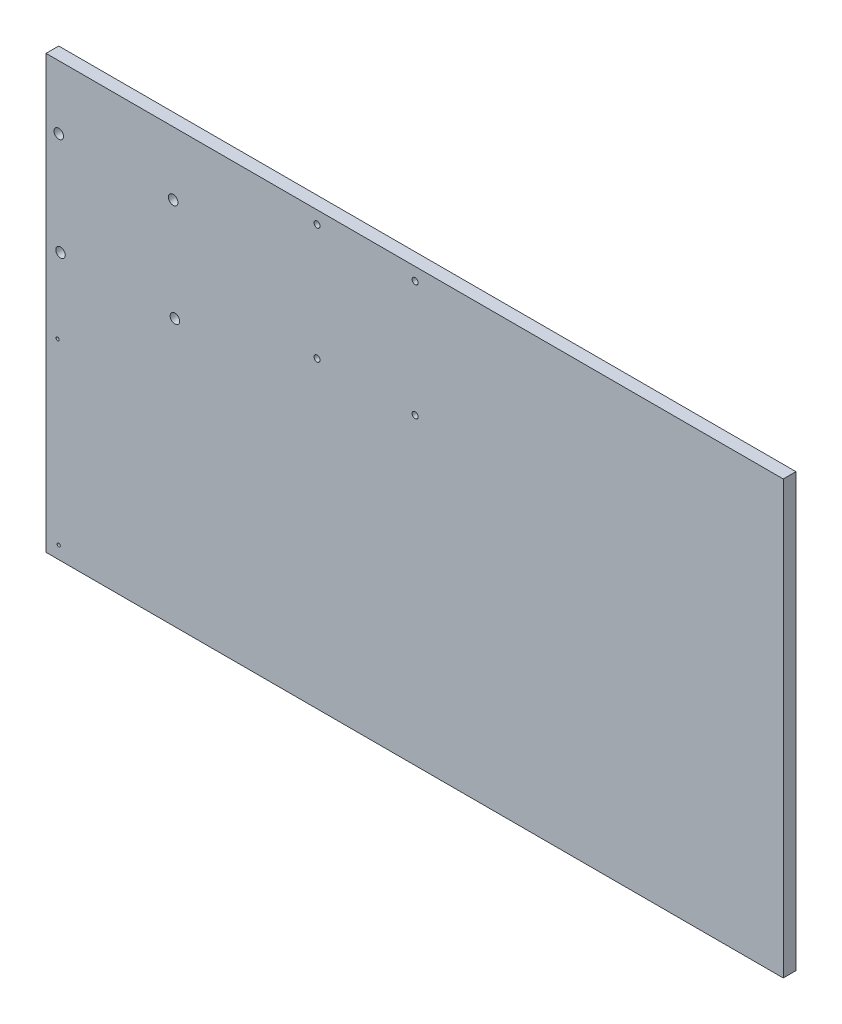
ISO-10303-21;
HEADER;
FILE_DESCRIPTION(('STEP AP214'),'2;1');
FILE_NAME('part.step','',(''),(''),'','','');
FILE_SCHEMA(('AUTOMOTIVE_DESIGN { 1 0 10303 214 1 1 1 1 }'));
ENDSEC;
DATA;
#1=APPLICATION_CONTEXT('core data for automotive mechanical design processes');
#2=APPLICATION_PROTOCOL_DEFINITION('international standard','automotive_design',2000,#1);
#3=PRODUCT_CONTEXT('',#1,'mechanical');
#4=PRODUCT('Part','Part','',(#3));
#5=PRODUCT_RELATED_PRODUCT_CATEGORY('part','',(#4));
#6=PRODUCT_DEFINITION_FORMATION('','',#4);
#7=PRODUCT_DEFINITION_CONTEXT('part definition',#1,'design');
#8=PRODUCT_DEFINITION('design','',#6,#7);
#9=PRODUCT_DEFINITION_SHAPE('','',#8);
#10=(LENGTH_UNIT() NAMED_UNIT(*) SI_UNIT(.MILLI.,.METRE.));
#11=(NAMED_UNIT(*) PLANE_ANGLE_UNIT() SI_UNIT($,.RADIAN.));
#12=(NAMED_UNIT(*) SI_UNIT($,.STERADIAN.) SOLID_ANGLE_UNIT());
#13=UNCERTAINTY_MEASURE_WITH_UNIT(LENGTH_MEASURE(1.E-05),#10,'distance_accuracy_value','');
#14=(GEOMETRIC_REPRESENTATION_CONTEXT(3) GLOBAL_UNCERTAINTY_ASSIGNED_CONTEXT((#13)) GLOBAL_UNIT_ASSIGNED_CONTEXT((#10,
#11,#12)) REPRESENTATION_CONTEXT('',''));
#15=CARTESIAN_POINT('',(0.,0.,0.));
#16=DIRECTION('',(0.,0.,1.));
#17=DIRECTION('',(1.,0.,0.));
#18=AXIS2_PLACEMENT_3D('',#15,#16,#17);
#19=CARTESIAN_POINT('',(0.,0.,6.35));
#20=DIRECTION('',(0.,1.,0.));
#21=DIRECTION('',(0.,0.,1.));
#22=AXIS2_PLACEMENT_3D('',#19,#20,#21);
#23=PLANE('',#22);
#24=DIRECTION('',(1.,0.,0.));
#25=VECTOR('',#24,1.);
#26=CARTESIAN_POINT('',(0.,0.,0.));
#27=LINE('',#26,#25);
#28=CARTESIAN_POINT('',(-215.9,0.,0.));
#29=VERTEX_POINT('',#28);
#30=CARTESIAN_POINT('',(152.4,0.,0.));
#31=VERTEX_POINT('',#30);
#32=EDGE_CURVE('E91',#29,#31,#27,.T.);
#33=ORIENTED_EDGE('',*,*,#32,.T.);
#34=DIRECTION('',(0.,0.,-1.));
#35=VECTOR('',#34,1.);
#36=CARTESIAN_POINT('',(152.4,0.,6.35));
#37=LINE('',#36,#35);
#38=CARTESIAN_POINT('',(152.4,0.,6.35));
#39=VERTEX_POINT('',#38);
#40=EDGE_CURVE('E94',#39,#31,#37,.T.);
#41=ORIENTED_EDGE('',*,*,#40,.F.);
#42=DIRECTION('',(1.,0.,0.));
#43=VECTOR('',#42,1.);
#44=CARTESIAN_POINT('',(0.,0.,6.35));
#45=LINE('',#44,#43);
#46=CARTESIAN_POINT('',(-215.9,0.,6.35));
#47=VERTEX_POINT('',#46);
#48=EDGE_CURVE('E78',#47,#39,#45,.T.);
#49=ORIENTED_EDGE('',*,*,#48,.F.);
#50=DIRECTION('',(0.,0.,-1.));
#51=VECTOR('',#50,1.);
#52=CARTESIAN_POINT('',(-215.9,0.,6.35));
#53=LINE('',#52,#51);
#54=EDGE_CURVE('E54',#47,#29,#53,.T.);
#55=ORIENTED_EDGE('',*,*,#54,.T.);
#56=EDGE_LOOP('',(#33,#41,#49,#55));
#57=FACE_BOUND('',#56,.T.);
#58=ADVANCED_FACE('F45',(#57),#23,.F.);
#59=CARTESIAN_POINT('',(0.,215.9,6.35));
#60=DIRECTION('',(0.,-1.,0.));
#61=DIRECTION('',(0.,0.,-1.));
#62=AXIS2_PLACEMENT_3D('',#59,#60,#61);
#63=PLANE('',#62);
#64=DIRECTION('',(-1.,0.,0.));
#65=VECTOR('',#64,1.);
#66=CARTESIAN_POINT('',(0.,215.9,0.));
#67=LINE('',#66,#65);
#68=CARTESIAN_POINT('',(152.4,215.9,0.));
#69=VERTEX_POINT('',#68);
#70=CARTESIAN_POINT('',(-215.9,215.9,0.));
#71=VERTEX_POINT('',#70);
#72=EDGE_CURVE('E73',#69,#71,#67,.T.);
#73=ORIENTED_EDGE('',*,*,#72,.T.);
#74=DIRECTION('',(0.,0.,-1.));
#75=VECTOR('',#74,1.);
#76=CARTESIAN_POINT('',(-215.9,215.9,6.35));
#77=LINE('',#76,#75);
#78=CARTESIAN_POINT('',(-215.9,215.9,6.35));
#79=VERTEX_POINT('',#78);
#80=EDGE_CURVE('E11',#79,#71,#77,.T.);
#81=ORIENTED_EDGE('',*,*,#80,.F.);
#82=DIRECTION('',(-1.,0.,0.));
#83=VECTOR('',#82,1.);
#84=CARTESIAN_POINT('',(0.,215.9,6.35));
#85=LINE('',#84,#83);
#86=CARTESIAN_POINT('',(152.4,215.9,6.35));
#87=VERTEX_POINT('',#86);
#88=EDGE_CURVE('E198',#87,#79,#85,.T.);
#89=ORIENTED_EDGE('',*,*,#88,.F.);
#90=DIRECTION('',(0.,0.,1.));
#91=VECTOR('',#90,1.);
#92=CARTESIAN_POINT('',(152.4,215.9,6.35));
#93=LINE('',#92,#91);
#94=EDGE_CURVE('E106',#69,#87,#93,.T.);
#95=ORIENTED_EDGE('',*,*,#94,.F.);
#96=EDGE_LOOP('',(#73,#81,#89,#95));
#97=FACE_BOUND('',#96,.T.);
#98=ADVANCED_FACE('F210',(#97),#63,.F.);
#99=CARTESIAN_POINT('',(-215.9,0.,6.35));
#100=DIRECTION('',(1.,0.,0.));
#101=DIRECTION('',(0.,0.,-1.));
#102=AXIS2_PLACEMENT_3D('',#99,#100,#101);
#103=PLANE('',#102);
#104=DIRECTION('',(0.,-1.,0.));
#105=VECTOR('',#104,1.);
#106=CARTESIAN_POINT('',(-215.9,0.,0.));
#107=LINE('',#106,#105);
#108=EDGE_CURVE('E199',#71,#29,#107,.T.);
#109=ORIENTED_EDGE('',*,*,#108,.T.);
#110=ORIENTED_EDGE('',*,*,#54,.F.);
#111=DIRECTION('',(0.,-1.,0.));
#112=VECTOR('',#111,1.);
#113=CARTESIAN_POINT('',(-215.9,0.,6.35));
#114=LINE('',#113,#112);
#115=EDGE_CURVE('E62',#79,#47,#114,.T.);
#116=ORIENTED_EDGE('',*,*,#115,.F.);
#117=ORIENTED_EDGE('',*,*,#80,.T.);
#118=EDGE_LOOP('',(#109,#110,#116,#117));
#119=FACE_BOUND('',#118,.T.);
#120=ADVANCED_FACE('F209',(#119),#103,.F.);
#121=CARTESIAN_POINT('',(0.,0.,6.35));
#122=DIRECTION('',(0.,0.,-1.));
#123=DIRECTION('',(-1.,0.,0.));
#124=AXIS2_PLACEMENT_3D('',#121,#122,#123);
#125=PLANE('',#124);
#126=CARTESIAN_POINT('',(-31.5155627154754,209.55,6.35));
#127=DIRECTION('',(0.,0.,1.));
#128=DIRECTION('',(1.,0.,0.));
#129=AXIS2_PLACEMENT_3D('',#126,#127,#128);
#130=CIRCLE('',#129,1.4986);
#131=CARTESIAN_POINT('',(-30.0169627154754,209.55,6.35));
#132=VERTEX_POINT('',#131);
#133=EDGE_CURVE('E126',#132,#132,#130,.T.);
#134=ORIENTED_EDGE('',*,*,#133,.F.);
#135=EDGE_LOOP('',(#134));
#136=FACE_BOUND('',#135,.T.);
#137=CARTESIAN_POINT('',(-80.5121627154754,151.5618,6.35));
#138=DIRECTION('',(0.,0.,1.));
#139=DIRECTION('',(1.,0.,0.));
#140=AXIS2_PLACEMENT_3D('',#137,#138,#139);
#141=CIRCLE('',#140,1.4986);
#142=CARTESIAN_POINT('',(-79.0135627154754,151.5618,6.35));
#143=VERTEX_POINT('',#142);
#144=EDGE_CURVE('E135',#143,#143,#141,.T.);
#145=ORIENTED_EDGE('',*,*,#144,.F.);
#146=EDGE_LOOP('',(#145));
#147=FACE_BOUND('',#146,.T.);
#148=CARTESIAN_POINT('',(-31.5155627154754,151.5618,6.35));
#149=DIRECTION('',(0.,0.,1.));
#150=DIRECTION('',(1.,0.,0.));
#151=AXIS2_PLACEMENT_3D('',#148,#149,#150);
#152=CIRCLE('',#151,1.4986);
#153=CARTESIAN_POINT('',(-30.0169627154754,151.5618,6.35));
#154=VERTEX_POINT('',#153);
#155=EDGE_CURVE('E118',#154,#154,#152,.T.);
#156=ORIENTED_EDGE('',*,*,#155,.F.);
#157=EDGE_LOOP('',(#156));
#158=FACE_BOUND('',#157,.T.);
#159=CARTESIAN_POINT('',(-80.5121627154754,209.55,6.35));
#160=DIRECTION('',(0.,0.,1.));
#161=DIRECTION('',(1.,0.,0.));
#162=AXIS2_PLACEMENT_3D('',#159,#160,#161);
#163=CIRCLE('',#162,1.4986);
#164=CARTESIAN_POINT('',(-79.0135627154754,209.55,6.35));
#165=VERTEX_POINT('',#164);
#166=EDGE_CURVE('E130',#165,#165,#163,.T.);
#167=ORIENTED_EDGE('',*,*,#166,.F.);
#168=EDGE_LOOP('',(#167));
#169=FACE_BOUND('',#168,.T.);
#170=CARTESIAN_POINT('',(-208.660508775967,133.348208490498,6.35));
#171=DIRECTION('',(0.,0.,1.));
#172=DIRECTION('',(1.,0.,0.));
#173=AXIS2_PLACEMENT_3D('',#170,#171,#172);
#174=CIRCLE('',#173,2.37490000000002);
#175=CARTESIAN_POINT('',(-206.285608775967,133.348208490498,6.35));
#176=VERTEX_POINT('',#175);
#177=EDGE_CURVE('E158',#176,#176,#174,.T.);
#178=ORIENTED_EDGE('',*,*,#177,.F.);
#179=EDGE_LOOP('',(#178));
#180=FACE_BOUND('',#179,.T.);
#181=CARTESIAN_POINT('',(-152.400004812137,184.279895950245,6.35));
#182=DIRECTION('',(0.,0.,1.));
#183=DIRECTION('',(1.,0.,0.));
#184=AXIS2_PLACEMENT_3D('',#181,#182,#183);
#185=CIRCLE('',#184,2.37490000000005);
#186=CARTESIAN_POINT('',(-150.025104812137,184.279895950245,6.35));
#187=VERTEX_POINT('',#186);
#188=EDGE_CURVE('E167',#187,#187,#185,.T.);
#189=ORIENTED_EDGE('',*,*,#188,.F.);
#190=EDGE_LOOP('',(#189));
#191=FACE_BOUND('',#190,.T.);
#192=CARTESIAN_POINT('',(-151.510508804045,133.349999962611,6.35));
#193=DIRECTION('',(0.,0.,1.));
#194=DIRECTION('',(1.,0.,0.));
#195=AXIS2_PLACEMENT_3D('',#192,#193,#194);
#196=CIRCLE('',#195,2.37490000000002);
#197=CARTESIAN_POINT('',(-149.135608804045,133.349999962611,6.35));
#198=VERTEX_POINT('',#197);
#199=EDGE_CURVE('E150',#198,#198,#196,.T.);
#200=ORIENTED_EDGE('',*,*,#199,.F.);
#201=EDGE_LOOP('',(#200));
#202=FACE_BOUND('',#201,.T.);
#203=CARTESIAN_POINT('',(-209.55,184.30334861012,6.35));
#204=DIRECTION('',(0.,0.,1.));
#205=DIRECTION('',(1.,0.,0.));
#206=AXIS2_PLACEMENT_3D('',#203,#204,#205);
#207=CIRCLE('',#206,2.37490000000002);
#208=CARTESIAN_POINT('',(-207.1751,184.30334861012,6.35));
#209=VERTEX_POINT('',#208);
#210=EDGE_CURVE('E162',#209,#209,#207,.T.);
#211=ORIENTED_EDGE('',*,*,#210,.F.);
#212=EDGE_LOOP('',(#211));
#213=FACE_BOUND('',#212,.T.);
#214=CARTESIAN_POINT('',(-209.55,6.35,6.35));
#215=DIRECTION('',(0.,0.,1.));
#216=DIRECTION('',(1.,0.,0.));
#217=AXIS2_PLACEMENT_3D('',#214,#215,#216);
#218=CIRCLE('',#217,0.798830000000004);
#219=CARTESIAN_POINT('',(-208.75117,6.35,6.35));
#220=VERTEX_POINT('',#219);
#221=EDGE_CURVE('E185',#220,#220,#218,.T.);
#222=ORIENTED_EDGE('',*,*,#221,.F.);
#223=EDGE_LOOP('',(#222));
#224=FACE_BOUND('',#223,.T.);
#225=CARTESIAN_POINT('',(-210.114382122255,95.2482084904981,6.35));
#226=DIRECTION('',(0.,0.,1.));
#227=DIRECTION('',(1.,0.,0.));
#228=AXIS2_PLACEMENT_3D('',#225,#226,#227);
#229=CIRCLE('',#228,0.798830000000004);
#230=CARTESIAN_POINT('',(-209.315552122255,95.2482084904981,6.35));
#231=VERTEX_POINT('',#230);
#232=EDGE_CURVE('E189',#231,#231,#229,.T.);
#233=ORIENTED_EDGE('',*,*,#232,.F.);
#234=EDGE_LOOP('',(#233));
#235=FACE_BOUND('',#234,.T.);
#236=ORIENTED_EDGE('',*,*,#48,.T.);
#237=DIRECTION('',(0.,-1.,0.));
#238=VECTOR('',#237,1.);
#239=CARTESIAN_POINT('',(152.4,0.,6.35));
#240=LINE('',#239,#238);
#241=EDGE_CURVE('E109',#87,#39,#240,.T.);
#242=ORIENTED_EDGE('',*,*,#241,.F.);
#243=ORIENTED_EDGE('',*,*,#88,.T.);
#244=ORIENTED_EDGE('',*,*,#115,.T.);
#245=EDGE_LOOP('',(#236,#242,#243,#244));
#246=FACE_BOUND('',#245,.T.);
#247=ADVANCED_FACE('F211',(#136,#147,#158,#169,#180,#191,#202,#213,#224,#235,#246),#125,.F.);
#248=CARTESIAN_POINT('',(0.,0.,0.));
#249=DIRECTION('',(0.,0.,-1.));
#250=DIRECTION('',(-1.,0.,0.));
#251=AXIS2_PLACEMENT_3D('',#248,#249,#250);
#252=PLANE('',#251);
#253=CARTESIAN_POINT('',(-31.5155627154754,209.55,0.));
#254=DIRECTION('',(0.,0.,1.));
#255=DIRECTION('',(1.,0.,0.));
#256=AXIS2_PLACEMENT_3D('',#253,#254,#255);
#257=CIRCLE('',#256,1.4986);
#258=CARTESIAN_POINT('',(-30.0169627154754,209.55,0.));
#259=VERTEX_POINT('',#258);
#260=EDGE_CURVE('E131',#259,#259,#257,.T.);
#261=ORIENTED_EDGE('',*,*,#260,.T.);
#262=EDGE_LOOP('',(#261));
#263=FACE_BOUND('',#262,.T.);
#264=CARTESIAN_POINT('',(-80.5121627154754,151.5618,0.));
#265=DIRECTION('',(0.,0.,1.));
#266=DIRECTION('',(1.,0.,0.));
#267=AXIS2_PLACEMENT_3D('',#264,#265,#266);
#268=CIRCLE('',#267,1.4986);
#269=CARTESIAN_POINT('',(-79.0135627154754,151.5618,0.));
#270=VERTEX_POINT('',#269);
#271=EDGE_CURVE('E122',#270,#270,#268,.T.);
#272=ORIENTED_EDGE('',*,*,#271,.T.);
#273=EDGE_LOOP('',(#272));
#274=FACE_BOUND('',#273,.T.);
#275=CARTESIAN_POINT('',(-31.5155627154754,151.5618,0.));
#276=DIRECTION('',(0.,0.,1.));
#277=DIRECTION('',(1.,0.,0.));
#278=AXIS2_PLACEMENT_3D('',#275,#276,#277);
#279=CIRCLE('',#278,1.4986);
#280=CARTESIAN_POINT('',(-30.0169627154754,151.5618,0.));
#281=VERTEX_POINT('',#280);
#282=EDGE_CURVE('E117',#281,#281,#279,.T.);
#283=ORIENTED_EDGE('',*,*,#282,.T.);
#284=EDGE_LOOP('',(#283));
#285=FACE_BOUND('',#284,.T.);
#286=CARTESIAN_POINT('',(-80.5121627154754,209.55,0.));
#287=DIRECTION('',(0.,0.,1.));
#288=DIRECTION('',(1.,0.,0.));
#289=AXIS2_PLACEMENT_3D('',#286,#287,#288);
#290=CIRCLE('',#289,1.4986);
#291=CARTESIAN_POINT('',(-79.0135627154754,209.55,0.));
#292=VERTEX_POINT('',#291);
#293=EDGE_CURVE('E142',#292,#292,#290,.T.);
#294=ORIENTED_EDGE('',*,*,#293,.T.);
#295=EDGE_LOOP('',(#294));
#296=FACE_BOUND('',#295,.T.);
#297=CARTESIAN_POINT('',(-208.660508775967,133.348208490498,0.));
#298=DIRECTION('',(0.,0.,1.));
#299=DIRECTION('',(1.,0.,0.));
#300=AXIS2_PLACEMENT_3D('',#297,#298,#299);
#301=CIRCLE('',#300,2.37490000000002);
#302=CARTESIAN_POINT('',(-206.285608775967,133.348208490498,0.));
#303=VERTEX_POINT('',#302);
#304=EDGE_CURVE('E163',#303,#303,#301,.T.);
#305=ORIENTED_EDGE('',*,*,#304,.T.);
#306=EDGE_LOOP('',(#305));
#307=FACE_BOUND('',#306,.T.);
#308=CARTESIAN_POINT('',(-152.400004812137,184.279895950245,0.));
#309=DIRECTION('',(0.,0.,1.));
#310=DIRECTION('',(1.,0.,0.));
#311=AXIS2_PLACEMENT_3D('',#308,#309,#310);
#312=CIRCLE('',#311,2.37490000000005);
#313=CARTESIAN_POINT('',(-150.025104812137,184.279895950245,0.));
#314=VERTEX_POINT('',#313);
#315=EDGE_CURVE('E154',#314,#314,#312,.T.);
#316=ORIENTED_EDGE('',*,*,#315,.T.);
#317=EDGE_LOOP('',(#316));
#318=FACE_BOUND('',#317,.T.);
#319=CARTESIAN_POINT('',(-151.510508804045,133.349999962611,0.));
#320=DIRECTION('',(0.,0.,1.));
#321=DIRECTION('',(1.,0.,0.));
#322=AXIS2_PLACEMENT_3D('',#319,#320,#321);
#323=CIRCLE('',#322,2.37490000000002);
#324=CARTESIAN_POINT('',(-149.135608804045,133.349999962611,0.));
#325=VERTEX_POINT('',#324);
#326=EDGE_CURVE('E146',#325,#325,#323,.T.);
#327=ORIENTED_EDGE('',*,*,#326,.T.);
#328=EDGE_LOOP('',(#327));
#329=FACE_BOUND('',#328,.T.);
#330=CARTESIAN_POINT('',(-209.55,184.30334861012,0.));
#331=DIRECTION('',(0.,0.,1.));
#332=DIRECTION('',(1.,0.,0.));
#333=AXIS2_PLACEMENT_3D('',#330,#331,#332);
#334=CIRCLE('',#333,2.37490000000002);
#335=CARTESIAN_POINT('',(-207.1751,184.30334861012,0.));
#336=VERTEX_POINT('',#335);
#337=EDGE_CURVE('E174',#336,#336,#334,.T.);
#338=ORIENTED_EDGE('',*,*,#337,.T.);
#339=EDGE_LOOP('',(#338));
#340=FACE_BOUND('',#339,.T.);
#341=CARTESIAN_POINT('',(-209.55,6.35,0.));
#342=DIRECTION('',(0.,0.,1.));
#343=DIRECTION('',(1.,0.,0.));
#344=AXIS2_PLACEMENT_3D('',#341,#342,#343);
#345=CIRCLE('',#344,0.798830000000004);
#346=CARTESIAN_POINT('',(-208.75117,6.35,0.));
#347=VERTEX_POINT('',#346);
#348=EDGE_CURVE('E98',#347,#347,#345,.T.);
#349=ORIENTED_EDGE('',*,*,#348,.T.);
#350=EDGE_LOOP('',(#349));
#351=FACE_BOUND('',#350,.T.);
#352=CARTESIAN_POINT('',(-210.114382122255,95.2482084904981,0.));
#353=DIRECTION('',(0.,0.,1.));
#354=DIRECTION('',(1.,0.,0.));
#355=AXIS2_PLACEMENT_3D('',#352,#353,#354);
#356=CIRCLE('',#355,0.798830000000004);
#357=CARTESIAN_POINT('',(-209.315552122255,95.2482084904981,0.));
#358=VERTEX_POINT('',#357);
#359=EDGE_CURVE('E178',#358,#358,#356,.T.);
#360=ORIENTED_EDGE('',*,*,#359,.T.);
#361=EDGE_LOOP('',(#360));
#362=FACE_BOUND('',#361,.T.);
#363=ORIENTED_EDGE('',*,*,#32,.F.);
#364=ORIENTED_EDGE('',*,*,#108,.F.);
#365=ORIENTED_EDGE('',*,*,#72,.F.);
#366=DIRECTION('',(0.,1.,0.));
#367=VECTOR('',#366,1.);
#368=CARTESIAN_POINT('',(152.4,0.,0.));
#369=LINE('',#368,#367);
#370=EDGE_CURVE('E101',#31,#69,#369,.T.);
#371=ORIENTED_EDGE('',*,*,#370,.F.);
#372=EDGE_LOOP('',(#363,#364,#365,#371));
#373=FACE_BOUND('',#372,.T.);
#374=ADVANCED_FACE('F102',(#263,#274,#285,#296,#307,#318,#329,#340,#351,#362,#373),#252,.T.);
#375=CARTESIAN_POINT('',(-210.114382122255,95.2482084904981,0.));
#376=DIRECTION('',(0.,0.,1.));
#377=DIRECTION('',(1.,0.,0.));
#378=AXIS2_PLACEMENT_3D('',#375,#376,#377);
#379=CYLINDRICAL_SURFACE('',#378,0.798830000000004);
#380=ORIENTED_EDGE('',*,*,#359,.F.);
#381=EDGE_LOOP('',(#380));
#382=FACE_BOUND('',#381,.T.);
#383=ORIENTED_EDGE('',*,*,#232,.T.);
#384=EDGE_LOOP('',(#383));
#385=FACE_BOUND('',#384,.T.);
#386=ADVANCED_FACE('F219',(#382,#385),#379,.F.);
#387=CARTESIAN_POINT('',(-209.55,6.35,0.));
#388=DIRECTION('',(0.,0.,1.));
#389=DIRECTION('',(1.,0.,0.));
#390=AXIS2_PLACEMENT_3D('',#387,#388,#389);
#391=CYLINDRICAL_SURFACE('',#390,0.798830000000004);
#392=ORIENTED_EDGE('',*,*,#348,.F.);
#393=EDGE_LOOP('',(#392));
#394=FACE_BOUND('',#393,.T.);
#395=ORIENTED_EDGE('',*,*,#221,.T.);
#396=EDGE_LOOP('',(#395));
#397=FACE_BOUND('',#396,.T.);
#398=ADVANCED_FACE('F334',(#394,#397),#391,.F.);
#399=CARTESIAN_POINT('',(-209.55,184.30334861012,0.));
#400=DIRECTION('',(0.,0.,1.));
#401=DIRECTION('',(1.,0.,0.));
#402=AXIS2_PLACEMENT_3D('',#399,#400,#401);
#403=CYLINDRICAL_SURFACE('',#402,2.37490000000002);
#404=ORIENTED_EDGE('',*,*,#337,.F.);
#405=EDGE_LOOP('',(#404));
#406=FACE_BOUND('',#405,.T.);
#407=ORIENTED_EDGE('',*,*,#210,.T.);
#408=EDGE_LOOP('',(#407));
#409=FACE_BOUND('',#408,.T.);
#410=ADVANCED_FACE('F325',(#406,#409),#403,.F.);
#411=CARTESIAN_POINT('',(-151.510508804045,133.349999962611,0.));
#412=DIRECTION('',(0.,0.,1.));
#413=DIRECTION('',(1.,0.,0.));
#414=AXIS2_PLACEMENT_3D('',#411,#412,#413);
#415=CYLINDRICAL_SURFACE('',#414,2.37490000000002);
#416=ORIENTED_EDGE('',*,*,#326,.F.);
#417=EDGE_LOOP('',(#416));
#418=FACE_BOUND('',#417,.T.);
#419=ORIENTED_EDGE('',*,*,#199,.T.);
#420=EDGE_LOOP('',(#419));
#421=FACE_BOUND('',#420,.T.);
#422=ADVANCED_FACE('F316',(#418,#421),#415,.F.);
#423=CARTESIAN_POINT('',(-152.400004812137,184.279895950245,0.));
#424=DIRECTION('',(0.,0.,1.));
#425=DIRECTION('',(1.,0.,0.));
#426=AXIS2_PLACEMENT_3D('',#423,#424,#425);
#427=CYLINDRICAL_SURFACE('',#426,2.37490000000005);
#428=ORIENTED_EDGE('',*,*,#315,.F.);
#429=EDGE_LOOP('',(#428));
#430=FACE_BOUND('',#429,.T.);
#431=ORIENTED_EDGE('',*,*,#188,.T.);
#432=EDGE_LOOP('',(#431));
#433=FACE_BOUND('',#432,.T.);
#434=ADVANCED_FACE('F307',(#430,#433),#427,.F.);
#435=CARTESIAN_POINT('',(-208.660508775967,133.348208490498,0.));
#436=DIRECTION('',(0.,0.,1.));
#437=DIRECTION('',(1.,0.,0.));
#438=AXIS2_PLACEMENT_3D('',#435,#436,#437);
#439=CYLINDRICAL_SURFACE('',#438,2.37490000000002);
#440=ORIENTED_EDGE('',*,*,#304,.F.);
#441=EDGE_LOOP('',(#440));
#442=FACE_BOUND('',#441,.T.);
#443=ORIENTED_EDGE('',*,*,#177,.T.);
#444=EDGE_LOOP('',(#443));
#445=FACE_BOUND('',#444,.T.);
#446=ADVANCED_FACE('F298',(#442,#445),#439,.F.);
#447=CARTESIAN_POINT('',(-80.5121627154754,209.55,0.));
#448=DIRECTION('',(0.,0.,1.));
#449=DIRECTION('',(1.,0.,0.));
#450=AXIS2_PLACEMENT_3D('',#447,#448,#449);
#451=CYLINDRICAL_SURFACE('',#450,1.4986);
#452=ORIENTED_EDGE('',*,*,#293,.F.);
#453=EDGE_LOOP('',(#452));
#454=FACE_BOUND('',#453,.T.);
#455=ORIENTED_EDGE('',*,*,#166,.T.);
#456=EDGE_LOOP('',(#455));
#457=FACE_BOUND('',#456,.T.);
#458=ADVANCED_FACE('F289',(#454,#457),#451,.F.);
#459=CARTESIAN_POINT('',(-31.5155627154754,151.5618,0.));
#460=DIRECTION('',(0.,0.,1.));
#461=DIRECTION('',(1.,0.,0.));
#462=AXIS2_PLACEMENT_3D('',#459,#460,#461);
#463=CYLINDRICAL_SURFACE('',#462,1.4986);
#464=ORIENTED_EDGE('',*,*,#282,.F.);
#465=EDGE_LOOP('',(#464));
#466=FACE_BOUND('',#465,.T.);
#467=ORIENTED_EDGE('',*,*,#155,.T.);
#468=EDGE_LOOP('',(#467));
#469=FACE_BOUND('',#468,.T.);
#470=ADVANCED_FACE('F280',(#466,#469),#463,.F.);
#471=CARTESIAN_POINT('',(-80.5121627154754,151.5618,0.));
#472=DIRECTION('',(0.,0.,1.));
#473=DIRECTION('',(1.,0.,0.));
#474=AXIS2_PLACEMENT_3D('',#471,#472,#473);
#475=CYLINDRICAL_SURFACE('',#474,1.4986);
#476=ORIENTED_EDGE('',*,*,#271,.F.);
#477=EDGE_LOOP('',(#476));
#478=FACE_BOUND('',#477,.T.);
#479=ORIENTED_EDGE('',*,*,#144,.T.);
#480=EDGE_LOOP('',(#479));
#481=FACE_BOUND('',#480,.T.);
#482=ADVANCED_FACE('F271',(#478,#481),#475,.F.);
#483=CARTESIAN_POINT('',(-31.5155627154754,209.55,0.));
#484=DIRECTION('',(0.,0.,1.));
#485=DIRECTION('',(1.,0.,0.));
#486=AXIS2_PLACEMENT_3D('',#483,#484,#485);
#487=CYLINDRICAL_SURFACE('',#486,1.4986);
#488=ORIENTED_EDGE('',*,*,#260,.F.);
#489=EDGE_LOOP('',(#488));
#490=FACE_BOUND('',#489,.T.);
#491=ORIENTED_EDGE('',*,*,#133,.T.);
#492=EDGE_LOOP('',(#491));
#493=FACE_BOUND('',#492,.T.);
#494=ADVANCED_FACE('F264',(#490,#493),#487,.F.);
#495=CARTESIAN_POINT('',(152.4,0.,0.));
#496=DIRECTION('',(1.,0.,0.));
#497=DIRECTION('',(0.,0.,-1.));
#498=AXIS2_PLACEMENT_3D('',#495,#496,#497);
#499=PLANE('',#498);
#500=ORIENTED_EDGE('',*,*,#40,.T.);
#501=ORIENTED_EDGE('',*,*,#370,.T.);
#502=ORIENTED_EDGE('',*,*,#94,.T.);
#503=ORIENTED_EDGE('',*,*,#241,.T.);
#504=EDGE_LOOP('',(#500,#501,#502,#503));
#505=FACE_BOUND('',#504,.T.);
#506=ADVANCED_FACE('F108',(#505),#499,.T.);
#507=CLOSED_SHELL('',(#58,#98,#120,#247,#374,#386,#398,#410,#422,#434,#446,#458,#470,#482,#494,#506));
#508=MANIFOLD_SOLID_BREP('B2',#507);
#509=ADVANCED_BREP_SHAPE_REPRESENTATION('',(#18,#508),#14);
#510=SHAPE_DEFINITION_REPRESENTATION(#9,#509);
ENDSEC;
END-ISO-10303-21;
